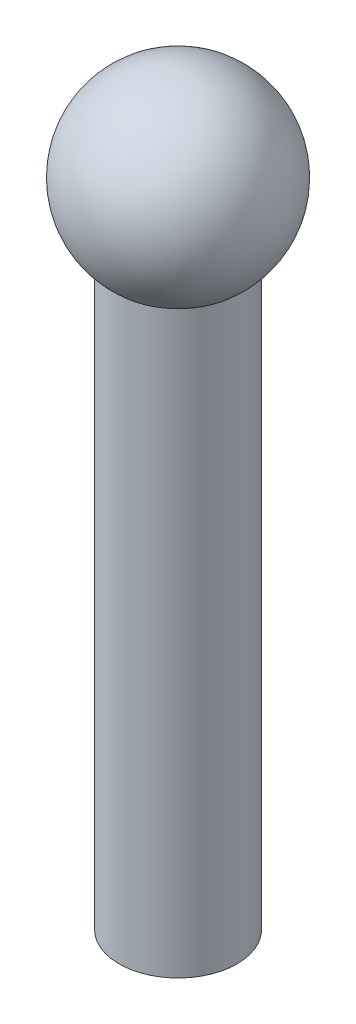
ISO-10303-21;
HEADER;
FILE_DESCRIPTION(('STEP AP214'),'2;1');
FILE_NAME('part.step','',(''),(''),'','','');
FILE_SCHEMA(('AUTOMOTIVE_DESIGN { 1 0 10303 214 1 1 1 1 }'));
ENDSEC;
DATA;
#1=APPLICATION_CONTEXT('core data for automotive mechanical design processes');
#2=APPLICATION_PROTOCOL_DEFINITION('international standard','automotive_design',2000,#1);
#3=PRODUCT_CONTEXT('',#1,'mechanical');
#4=PRODUCT('Part','Part','',(#3));
#5=PRODUCT_RELATED_PRODUCT_CATEGORY('part','',(#4));
#6=PRODUCT_DEFINITION_FORMATION('','',#4);
#7=PRODUCT_DEFINITION_CONTEXT('part definition',#1,'design');
#8=PRODUCT_DEFINITION('design','',#6,#7);
#9=PRODUCT_DEFINITION_SHAPE('','',#8);
#10=(LENGTH_UNIT() NAMED_UNIT(*) SI_UNIT(.MILLI.,.METRE.));
#11=(NAMED_UNIT(*) PLANE_ANGLE_UNIT() SI_UNIT($,.RADIAN.));
#12=(NAMED_UNIT(*) SI_UNIT($,.STERADIAN.) SOLID_ANGLE_UNIT());
#13=UNCERTAINTY_MEASURE_WITH_UNIT(LENGTH_MEASURE(1.E-05),#10,'distance_accuracy_value','');
#14=(GEOMETRIC_REPRESENTATION_CONTEXT(3) GLOBAL_UNCERTAINTY_ASSIGNED_CONTEXT((#13)) GLOBAL_UNIT_ASSIGNED_CONTEXT((#10,
#11,#12)) REPRESENTATION_CONTEXT('',''));
#15=CARTESIAN_POINT('',(0.,0.,0.));
#16=DIRECTION('',(0.,0.,1.));
#17=DIRECTION('',(1.,0.,0.));
#18=AXIS2_PLACEMENT_3D('',#15,#16,#17);
#19=CARTESIAN_POINT('',(0.,3.,0.));
#20=DIRECTION('',(0.,-1.,0.));
#21=DIRECTION('',(1.,0.,0.));
#22=AXIS2_PLACEMENT_3D('',#19,#20,#21);
#23=CYLINDRICAL_SURFACE('',#22,4.755);
#24=CARTESIAN_POINT('',(0.,1.70000215517281,0.));
#25=DIRECTION('',(0.,1.,0.));
#26=DIRECTION('',(-1.,0.,0.));
#27=AXIS2_PLACEMENT_3D('',#24,#25,#26);
#28=CIRCLE('',#27,4.755);
#29=CARTESIAN_POINT('',(-4.755,1.70000215517281,0.));
#30=VERTEX_POINT('',#29);
#31=EDGE_CURVE('E10',#30,#30,#28,.T.);
#32=ORIENTED_EDGE('',*,*,#31,.F.);
#33=EDGE_LOOP('',(#32));
#34=FACE_BOUND('',#33,.T.);
#35=CARTESIAN_POINT('',(0.,-45.,0.));
#36=DIRECTION('',(0.,-1.,0.));
#37=DIRECTION('',(1.,0.,0.));
#38=AXIS2_PLACEMENT_3D('',#35,#36,#37);
#39=CIRCLE('',#38,4.755);
#40=CARTESIAN_POINT('',(4.755,-45.,0.));
#41=VERTEX_POINT('',#40);
#42=EDGE_CURVE('E42',#41,#41,#39,.T.);
#43=ORIENTED_EDGE('',*,*,#42,.F.);
#44=EDGE_LOOP('',(#43));
#45=FACE_BOUND('',#44,.T.);
#46=ADVANCED_FACE('F35',(#34,#45),#23,.T.);
#47=CARTESIAN_POINT('',(0.,7.5,0.));
#48=DIRECTION('',(0.,-1.,0.));
#49=DIRECTION('',(-1.,0.,0.));
#50=AXIS2_PLACEMENT_3D('',#47,#48,#49);
#51=SPHERICAL_SURFACE('',#50,7.5);
#52=ORIENTED_EDGE('',*,*,#31,.T.);
#53=EDGE_LOOP('',(#52));
#54=FACE_BOUND('',#53,.T.);
#55=ADVANCED_FACE('F37',(#54),#51,.T.);
#56=CARTESIAN_POINT('',(0.,-45.,0.));
#57=DIRECTION('',(0.,-1.,0.));
#58=DIRECTION('',(1.,0.,0.));
#59=AXIS2_PLACEMENT_3D('',#56,#57,#58);
#60=PLANE('',#59);
#61=ORIENTED_EDGE('',*,*,#42,.T.);
#62=EDGE_LOOP('',(#61));
#63=FACE_BOUND('',#62,.T.);
#64=ADVANCED_FACE('F48',(#63),#60,.T.);
#65=CLOSED_SHELL('',(#46,#55,#64));
#66=MANIFOLD_SOLID_BREP('B2',#65);
#67=ADVANCED_BREP_SHAPE_REPRESENTATION('',(#18,#66),#14);
#68=SHAPE_DEFINITION_REPRESENTATION(#9,#67);
ENDSEC;
END-ISO-10303-21;
